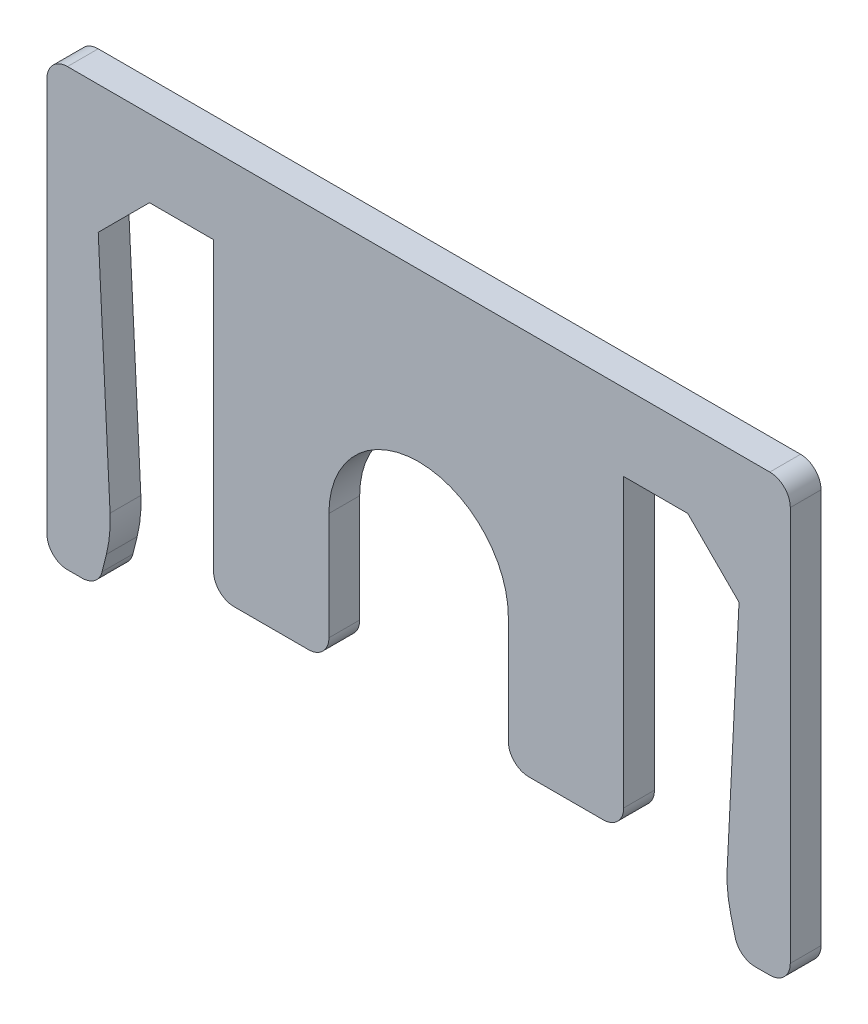
ISO-10303-21;
HEADER;
FILE_DESCRIPTION(('STEP AP214'),'2;1');
FILE_NAME('part.step','',(''),(''),'','','');
FILE_SCHEMA(('AUTOMOTIVE_DESIGN { 1 0 10303 214 1 1 1 1 }'));
ENDSEC;
DATA;
#1=APPLICATION_CONTEXT('core data for automotive mechanical design processes');
#2=APPLICATION_PROTOCOL_DEFINITION('international standard','automotive_design',2000,#1);
#3=PRODUCT_CONTEXT('',#1,'mechanical');
#4=PRODUCT('Part','Part','',(#3));
#5=PRODUCT_RELATED_PRODUCT_CATEGORY('part','',(#4));
#6=PRODUCT_DEFINITION_FORMATION('','',#4);
#7=PRODUCT_DEFINITION_CONTEXT('part definition',#1,'design');
#8=PRODUCT_DEFINITION('design','',#6,#7);
#9=PRODUCT_DEFINITION_SHAPE('','',#8);
#10=(LENGTH_UNIT() NAMED_UNIT(*) SI_UNIT(.MILLI.,.METRE.));
#11=(NAMED_UNIT(*) PLANE_ANGLE_UNIT() SI_UNIT($,.RADIAN.));
#12=(NAMED_UNIT(*) SI_UNIT($,.STERADIAN.) SOLID_ANGLE_UNIT());
#13=UNCERTAINTY_MEASURE_WITH_UNIT(LENGTH_MEASURE(1.E-05),#10,'distance_accuracy_value','');
#14=(GEOMETRIC_REPRESENTATION_CONTEXT(3) GLOBAL_UNCERTAINTY_ASSIGNED_CONTEXT((#13)) GLOBAL_UNIT_ASSIGNED_CONTEXT((#10,
#11,#12)) REPRESENTATION_CONTEXT('',''));
#15=CARTESIAN_POINT('',(0.,0.,0.));
#16=DIRECTION('',(0.,0.,1.));
#17=DIRECTION('',(1.,0.,0.));
#18=AXIS2_PLACEMENT_3D('',#15,#16,#17);
#19=CARTESIAN_POINT('',(-10.5,0.,1.2));
#20=DIRECTION('',(0.,1.,0.));
#21=DIRECTION('',(-1.,0.,0.));
#22=AXIS2_PLACEMENT_3D('',#19,#20,#21);
#23=PLANE('',#22);
#24=DIRECTION('',(1.,0.,0.));
#25=VECTOR('',#24,1.);
#26=CARTESIAN_POINT('',(-10.5,0.,0.));
#27=LINE('',#26,#25);
#28=CARTESIAN_POINT('',(-10.5,0.,0.));
#29=VERTEX_POINT('',#28);
#30=CARTESIAN_POINT('',(-8.,0.,0.));
#31=VERTEX_POINT('',#30);
#32=EDGE_CURVE('E277',#29,#31,#27,.T.);
#33=ORIENTED_EDGE('',*,*,#32,.T.);
#34=DIRECTION('',(0.,0.,-1.));
#35=VECTOR('',#34,1.);
#36=CARTESIAN_POINT('',(-8.,0.,1.2));
#37=LINE('',#36,#35);
#38=CARTESIAN_POINT('',(-8.,0.,1.2));
#39=VERTEX_POINT('',#38);
#40=EDGE_CURVE('E256',#39,#31,#37,.T.);
#41=ORIENTED_EDGE('',*,*,#40,.F.);
#42=DIRECTION('',(1.,0.,0.));
#43=VECTOR('',#42,1.);
#44=CARTESIAN_POINT('',(-10.5,0.,1.2));
#45=LINE('',#44,#43);
#46=CARTESIAN_POINT('',(-10.5,0.,1.2));
#47=VERTEX_POINT('',#46);
#48=EDGE_CURVE('E263',#47,#39,#45,.T.);
#49=ORIENTED_EDGE('',*,*,#48,.F.);
#50=DIRECTION('',(0.,0.,-1.));
#51=VECTOR('',#50,1.);
#52=CARTESIAN_POINT('',(-10.5,0.,1.2));
#53=LINE('',#52,#51);
#54=EDGE_CURVE('E518',#47,#29,#53,.T.);
#55=ORIENTED_EDGE('',*,*,#54,.T.);
#56=EDGE_LOOP('',(#33,#41,#49,#55));
#57=FACE_BOUND('',#56,.T.);
#58=ADVANCED_FACE('F39',(#57),#23,.F.);
#59=CARTESIAN_POINT('',(-8.,-12.,1.2));
#60=DIRECTION('',(1.,0.,0.));
#61=DIRECTION('',(0.,0.,-1.));
#62=AXIS2_PLACEMENT_3D('',#59,#60,#61);
#63=PLANE('',#62);
#64=DIRECTION('',(0.,-1.,0.));
#65=VECTOR('',#64,1.);
#66=CARTESIAN_POINT('',(-8.,-12.,0.));
#67=LINE('',#66,#65);
#68=CARTESIAN_POINT('',(-8.,-11.2,0.));
#69=VERTEX_POINT('',#68);
#70=EDGE_CURVE('E549',#31,#69,#67,.T.);
#71=ORIENTED_EDGE('',*,*,#70,.T.);
#72=DIRECTION('',(0.,0.,-1.));
#73=VECTOR('',#72,1.);
#74=CARTESIAN_POINT('',(-8.,-11.2,1.2));
#75=LINE('',#74,#73);
#76=CARTESIAN_POINT('',(-8.,-11.2,1.2));
#77=VERTEX_POINT('',#76);
#78=EDGE_CURVE('E259',#69,#77,#75,.F.);
#79=ORIENTED_EDGE('',*,*,#78,.T.);
#80=DIRECTION('',(0.,-1.,0.));
#81=VECTOR('',#80,1.);
#82=CARTESIAN_POINT('',(-8.,-12.,1.2));
#83=LINE('',#82,#81);
#84=EDGE_CURVE('E251',#39,#77,#83,.T.);
#85=ORIENTED_EDGE('',*,*,#84,.F.);
#86=ORIENTED_EDGE('',*,*,#40,.T.);
#87=EDGE_LOOP('',(#71,#79,#85,#86));
#88=FACE_BOUND('',#87,.T.);
#89=ADVANCED_FACE('F254',(#88),#63,.F.);
#90=CARTESIAN_POINT('',(-8.,-12.,1.2));
#91=DIRECTION('',(0.,1.,0.));
#92=DIRECTION('',(-1.,0.,0.));
#93=AXIS2_PLACEMENT_3D('',#90,#91,#92);
#94=PLANE('',#93);
#95=DIRECTION('',(1.,0.,0.));
#96=VECTOR('',#95,1.);
#97=CARTESIAN_POINT('',(-8.,-12.,1.2));
#98=LINE('',#97,#96);
#99=CARTESIAN_POINT('',(-7.2,-12.,1.2));
#100=VERTEX_POINT('',#99);
#101=CARTESIAN_POINT('',(-4.3,-12.,1.2));
#102=VERTEX_POINT('',#101);
#103=EDGE_CURVE('E262',#100,#102,#98,.T.);
#104=ORIENTED_EDGE('',*,*,#103,.F.);
#105=DIRECTION('',(0.,0.,-1.));
#106=VECTOR('',#105,1.);
#107=CARTESIAN_POINT('',(-7.2,-12.,1.2));
#108=LINE('',#107,#106);
#109=CARTESIAN_POINT('',(-7.2,-12.,0.));
#110=VERTEX_POINT('',#109);
#111=EDGE_CURVE('E418',#100,#110,#108,.T.);
#112=ORIENTED_EDGE('',*,*,#111,.T.);
#113=DIRECTION('',(1.,0.,0.));
#114=VECTOR('',#113,1.);
#115=CARTESIAN_POINT('',(-8.,-12.,0.));
#116=LINE('',#115,#114);
#117=CARTESIAN_POINT('',(-4.3,-12.,0.));
#118=VERTEX_POINT('',#117);
#119=EDGE_CURVE('E543',#110,#118,#116,.T.);
#120=ORIENTED_EDGE('',*,*,#119,.T.);
#121=DIRECTION('',(0.,0.,-1.));
#122=VECTOR('',#121,1.);
#123=CARTESIAN_POINT('',(-4.3,-12.,1.2));
#124=LINE('',#123,#122);
#125=EDGE_CURVE('E415',#118,#102,#124,.F.);
#126=ORIENTED_EDGE('',*,*,#125,.T.);
#127=EDGE_LOOP('',(#104,#112,#120,#126));
#128=FACE_BOUND('',#127,.T.);
#129=ADVANCED_FACE('F624',(#128),#94,.F.);
#130=CARTESIAN_POINT('',(-3.5,-7.,1.2));
#131=DIRECTION('',(-1.,0.,0.));
#132=DIRECTION('',(0.,-1.,0.));
#133=AXIS2_PLACEMENT_3D('',#130,#131,#132);
#134=PLANE('',#133);
#135=DIRECTION('',(0.,1.,0.));
#136=VECTOR('',#135,1.);
#137=CARTESIAN_POINT('',(-3.5,-7.,1.2));
#138=LINE('',#137,#136);
#139=CARTESIAN_POINT('',(-3.5,-11.2,1.2));
#140=VERTEX_POINT('',#139);
#141=CARTESIAN_POINT('',(-3.5,-7.,1.2));
#142=VERTEX_POINT('',#141);
#143=EDGE_CURVE('E600',#140,#142,#138,.T.);
#144=ORIENTED_EDGE('',*,*,#143,.F.);
#145=DIRECTION('',(0.,0.,-1.));
#146=VECTOR('',#145,1.);
#147=CARTESIAN_POINT('',(-3.5,-11.2,1.2));
#148=LINE('',#147,#146);
#149=CARTESIAN_POINT('',(-3.5,-11.2,0.));
#150=VERTEX_POINT('',#149);
#151=EDGE_CURVE('E11',#140,#150,#148,.T.);
#152=ORIENTED_EDGE('',*,*,#151,.T.);
#153=DIRECTION('',(0.,1.,0.));
#154=VECTOR('',#153,1.);
#155=CARTESIAN_POINT('',(-3.5,-7.,0.));
#156=LINE('',#155,#154);
#157=CARTESIAN_POINT('',(-3.5,-7.,0.));
#158=VERTEX_POINT('',#157);
#159=EDGE_CURVE('E540',#150,#158,#156,.T.);
#160=ORIENTED_EDGE('',*,*,#159,.T.);
#161=DIRECTION('',(0.,0.,-1.));
#162=VECTOR('',#161,1.);
#163=CARTESIAN_POINT('',(-3.5,-7.,1.2));
#164=LINE('',#163,#162);
#165=EDGE_CURVE('E280',#142,#158,#164,.T.);
#166=ORIENTED_EDGE('',*,*,#165,.F.);
#167=EDGE_LOOP('',(#144,#152,#160,#166));
#168=FACE_BOUND('',#167,.T.);
#169=ADVANCED_FACE('F614',(#168),#134,.F.);
#170=CARTESIAN_POINT('',(0.,-7.,1.2));
#171=DIRECTION('',(0.,0.,-1.));
#172=DIRECTION('',(-1.,0.,0.));
#173=AXIS2_PLACEMENT_3D('',#170,#171,#172);
#174=CYLINDRICAL_SURFACE('',#173,3.5);
#175=CARTESIAN_POINT('',(0.,-7.,0.));
#176=DIRECTION('',(0.,0.,-1.));
#177=DIRECTION('',(1.,0.,0.));
#178=AXIS2_PLACEMENT_3D('',#175,#176,#177);
#179=CIRCLE('',#178,3.5);
#180=CARTESIAN_POINT('',(3.5,-7.,0.));
#181=VERTEX_POINT('',#180);
#182=EDGE_CURVE('E474',#158,#181,#179,.T.);
#183=ORIENTED_EDGE('',*,*,#182,.T.);
#184=DIRECTION('',(0.,0.,-1.));
#185=VECTOR('',#184,1.);
#186=CARTESIAN_POINT('',(3.5,-7.,1.2));
#187=LINE('',#186,#185);
#188=CARTESIAN_POINT('',(3.5,-7.,1.2));
#189=VERTEX_POINT('',#188);
#190=EDGE_CURVE('E288',#189,#181,#187,.T.);
#191=ORIENTED_EDGE('',*,*,#190,.F.);
#192=CARTESIAN_POINT('',(0.,-7.,1.2));
#193=DIRECTION('',(0.,0.,-1.));
#194=DIRECTION('',(1.,0.,0.));
#195=AXIS2_PLACEMENT_3D('',#192,#193,#194);
#196=CIRCLE('',#195,3.5);
#197=EDGE_CURVE('E450',#142,#189,#196,.T.);
#198=ORIENTED_EDGE('',*,*,#197,.F.);
#199=ORIENTED_EDGE('',*,*,#165,.T.);
#200=EDGE_LOOP('',(#183,#191,#198,#199));
#201=FACE_BOUND('',#200,.T.);
#202=ADVANCED_FACE('F616',(#201),#174,.F.);
#203=CARTESIAN_POINT('',(3.5,-7.,1.2));
#204=DIRECTION('',(1.,0.,0.));
#205=DIRECTION('',(0.,1.,0.));
#206=AXIS2_PLACEMENT_3D('',#203,#204,#205);
#207=PLANE('',#206);
#208=DIRECTION('',(0.,-1.,0.));
#209=VECTOR('',#208,1.);
#210=CARTESIAN_POINT('',(3.5,-7.,0.));
#211=LINE('',#210,#209);
#212=CARTESIAN_POINT('',(3.5,-11.2,0.));
#213=VERTEX_POINT('',#212);
#214=EDGE_CURVE('E444',#181,#213,#211,.T.);
#215=ORIENTED_EDGE('',*,*,#214,.T.);
#216=DIRECTION('',(0.,0.,-1.));
#217=VECTOR('',#216,1.);
#218=CARTESIAN_POINT('',(3.5,-11.2,1.2));
#219=LINE('',#218,#217);
#220=CARTESIAN_POINT('',(3.5,-11.2,1.2));
#221=VERTEX_POINT('',#220);
#222=EDGE_CURVE('E48',#213,#221,#219,.F.);
#223=ORIENTED_EDGE('',*,*,#222,.T.);
#224=DIRECTION('',(0.,-1.,0.));
#225=VECTOR('',#224,1.);
#226=CARTESIAN_POINT('',(3.5,-7.,1.2));
#227=LINE('',#226,#225);
#228=EDGE_CURVE('E442',#189,#221,#227,.T.);
#229=ORIENTED_EDGE('',*,*,#228,.F.);
#230=ORIENTED_EDGE('',*,*,#190,.T.);
#231=EDGE_LOOP('',(#215,#223,#229,#230));
#232=FACE_BOUND('',#231,.T.);
#233=ADVANCED_FACE('F440',(#232),#207,.F.);
#234=CARTESIAN_POINT('',(3.5,-12.,1.2));
#235=DIRECTION('',(0.,1.,0.));
#236=DIRECTION('',(-1.,0.,0.));
#237=AXIS2_PLACEMENT_3D('',#234,#235,#236);
#238=PLANE('',#237);
#239=DIRECTION('',(1.,0.,0.));
#240=VECTOR('',#239,1.);
#241=CARTESIAN_POINT('',(3.5,-12.,0.));
#242=LINE('',#241,#240);
#243=CARTESIAN_POINT('',(4.3,-12.,0.));
#244=VERTEX_POINT('',#243);
#245=CARTESIAN_POINT('',(7.2,-12.,0.));
#246=VERTEX_POINT('',#245);
#247=EDGE_CURVE('E461',#244,#246,#242,.T.);
#248=ORIENTED_EDGE('',*,*,#247,.T.);
#249=DIRECTION('',(0.,0.,-1.));
#250=VECTOR('',#249,1.);
#251=CARTESIAN_POINT('',(7.2,-12.,1.2));
#252=LINE('',#251,#250);
#253=CARTESIAN_POINT('',(7.2,-12.,1.2));
#254=VERTEX_POINT('',#253);
#255=EDGE_CURVE('E432',#246,#254,#252,.F.);
#256=ORIENTED_EDGE('',*,*,#255,.T.);
#257=DIRECTION('',(1.,0.,0.));
#258=VECTOR('',#257,1.);
#259=CARTESIAN_POINT('',(3.5,-12.,1.2));
#260=LINE('',#259,#258);
#261=CARTESIAN_POINT('',(4.3,-12.,1.2));
#262=VERTEX_POINT('',#261);
#263=EDGE_CURVE('E453',#262,#254,#260,.T.);
#264=ORIENTED_EDGE('',*,*,#263,.F.);
#265=DIRECTION('',(0.,0.,-1.));
#266=VECTOR('',#265,1.);
#267=CARTESIAN_POINT('',(4.3,-12.,1.2));
#268=LINE('',#267,#266);
#269=EDGE_CURVE('E428',#262,#244,#268,.T.);
#270=ORIENTED_EDGE('',*,*,#269,.T.);
#271=EDGE_LOOP('',(#248,#256,#264,#270));
#272=FACE_BOUND('',#271,.T.);
#273=ADVANCED_FACE('F460',(#272),#238,.F.);
#274=CARTESIAN_POINT('',(8.,-12.,1.2));
#275=DIRECTION('',(-1.,0.,0.));
#276=DIRECTION('',(0.,0.,1.));
#277=AXIS2_PLACEMENT_3D('',#274,#275,#276);
#278=PLANE('',#277);
#279=DIRECTION('',(0.,1.,0.));
#280=VECTOR('',#279,1.);
#281=CARTESIAN_POINT('',(8.,-12.,1.2));
#282=LINE('',#281,#280);
#283=CARTESIAN_POINT('',(8.,-11.2,1.2));
#284=VERTEX_POINT('',#283);
#285=CARTESIAN_POINT('',(8.,0.,1.2));
#286=VERTEX_POINT('',#285);
#287=EDGE_CURVE('E593',#284,#286,#282,.T.);
#288=ORIENTED_EDGE('',*,*,#287,.F.);
#289=DIRECTION('',(0.,0.,-1.));
#290=VECTOR('',#289,1.);
#291=CARTESIAN_POINT('',(8.,-11.2,1.2));
#292=LINE('',#291,#290);
#293=CARTESIAN_POINT('',(8.,-11.2,0.));
#294=VERTEX_POINT('',#293);
#295=EDGE_CURVE('E424',#284,#294,#292,.T.);
#296=ORIENTED_EDGE('',*,*,#295,.T.);
#297=DIRECTION('',(0.,1.,0.));
#298=VECTOR('',#297,1.);
#299=CARTESIAN_POINT('',(8.,-12.,0.));
#300=LINE('',#299,#298);
#301=CARTESIAN_POINT('',(8.,0.,0.));
#302=VERTEX_POINT('',#301);
#303=EDGE_CURVE('E468',#294,#302,#300,.T.);
#304=ORIENTED_EDGE('',*,*,#303,.T.);
#305=DIRECTION('',(0.,0.,-1.));
#306=VECTOR('',#305,1.);
#307=CARTESIAN_POINT('',(8.,0.,1.2));
#308=LINE('',#307,#306);
#309=EDGE_CURVE('E533',#286,#302,#308,.T.);
#310=ORIENTED_EDGE('',*,*,#309,.F.);
#311=EDGE_LOOP('',(#288,#296,#304,#310));
#312=FACE_BOUND('',#311,.T.);
#313=ADVANCED_FACE('F834',(#312),#278,.F.);
#314=CARTESIAN_POINT('',(8.,0.,1.2));
#315=DIRECTION('',(0.,1.,0.));
#316=DIRECTION('',(-1.,0.,0.));
#317=AXIS2_PLACEMENT_3D('',#314,#315,#316);
#318=PLANE('',#317);
#319=DIRECTION('',(1.,0.,0.));
#320=VECTOR('',#319,1.);
#321=CARTESIAN_POINT('',(8.,0.,0.));
#322=LINE('',#321,#320);
#323=CARTESIAN_POINT('',(10.5,0.,0.));
#324=VERTEX_POINT('',#323);
#325=EDGE_CURVE('E472',#302,#324,#322,.T.);
#326=ORIENTED_EDGE('',*,*,#325,.T.);
#327=DIRECTION('',(0.,0.,-1.));
#328=VECTOR('',#327,1.);
#329=CARTESIAN_POINT('',(10.5,0.,1.2));
#330=LINE('',#329,#328);
#331=CARTESIAN_POINT('',(10.5,0.,1.2));
#332=VERTEX_POINT('',#331);
#333=EDGE_CURVE('E529',#332,#324,#330,.T.);
#334=ORIENTED_EDGE('',*,*,#333,.F.);
#335=DIRECTION('',(1.,0.,0.));
#336=VECTOR('',#335,1.);
#337=CARTESIAN_POINT('',(8.,0.,1.2));
#338=LINE('',#337,#336);
#339=EDGE_CURVE('E590',#286,#332,#338,.T.);
#340=ORIENTED_EDGE('',*,*,#339,.F.);
#341=ORIENTED_EDGE('',*,*,#309,.T.);
#342=EDGE_LOOP('',(#326,#334,#340,#341));
#343=FACE_BOUND('',#342,.T.);
#344=ADVANCED_FACE('F839',(#343),#318,.F.);
#345=CARTESIAN_POINT('',(12.5,-2.,1.2));
#346=DIRECTION('',(0.707106781186547,0.707106781186548,0.));
#347=DIRECTION('',(-0.707106781186548,0.707106781186547,0.));
#348=AXIS2_PLACEMENT_3D('',#345,#346,#347);
#349=PLANE('',#348);
#350=DIRECTION('',(0.707106781186548,-0.707106781186547,0.));
#351=VECTOR('',#350,1.);
#352=CARTESIAN_POINT('',(12.5,-2.,0.));
#353=LINE('',#352,#351);
#354=CARTESIAN_POINT('',(12.5,-2.,0.));
#355=VERTEX_POINT('',#354);
#356=EDGE_CURVE('E480',#324,#355,#353,.T.);
#357=ORIENTED_EDGE('',*,*,#356,.T.);
#358=DIRECTION('',(0.,0.,-1.));
#359=VECTOR('',#358,1.);
#360=CARTESIAN_POINT('',(12.5,-2.,1.2));
#361=LINE('',#360,#359);
#362=CARTESIAN_POINT('',(12.5,-2.,1.2));
#363=VERTEX_POINT('',#362);
#364=EDGE_CURVE('E525',#363,#355,#361,.T.);
#365=ORIENTED_EDGE('',*,*,#364,.F.);
#366=DIRECTION('',(0.707106781186548,-0.707106781186547,0.));
#367=VECTOR('',#366,1.);
#368=CARTESIAN_POINT('',(12.5,-2.,1.2));
#369=LINE('',#368,#367);
#370=EDGE_CURVE('E587',#332,#363,#369,.T.);
#371=ORIENTED_EDGE('',*,*,#370,.F.);
#372=ORIENTED_EDGE('',*,*,#333,.T.);
#373=EDGE_LOOP('',(#357,#365,#371,#372));
#374=FACE_BOUND('',#373,.T.);
#375=ADVANCED_FACE('F901',(#374),#349,.F.);
#376=CARTESIAN_POINT('',(12.,-12.,1.2));
#377=DIRECTION('',(0.998752338877844,-0.0499376169438947,0.));
#378=DIRECTION('',(0.0499376169438947,0.998752338877845,0.));
#379=AXIS2_PLACEMENT_3D('',#376,#377,#378);
#380=PLANE('',#379);
#381=DIRECTION('',(-0.0499376169438947,-0.998752338877845,0.));
#382=VECTOR('',#381,1.);
#383=CARTESIAN_POINT('',(12.,-12.,0.));
#384=LINE('',#383,#382);
#385=CARTESIAN_POINT('',(12.0370903931354,-11.2581921372909,0.));
#386=VERTEX_POINT('',#385);
#387=EDGE_CURVE('E483',#355,#386,#384,.T.);
#388=ORIENTED_EDGE('',*,*,#387,.T.);
#389=DIRECTION('',(0.,0.,-1.));
#390=VECTOR('',#389,1.);
#391=CARTESIAN_POINT('',(12.0370903931354,-11.2581921372909,1.2));
#392=LINE('',#391,#390);
#393=CARTESIAN_POINT('',(12.0370903931354,-11.2581921372909,1.2));
#394=VERTEX_POINT('',#393);
#395=EDGE_CURVE('E312',#386,#394,#392,.F.);
#396=ORIENTED_EDGE('',*,*,#395,.T.);
#397=DIRECTION('',(-0.0499376169438947,-0.998752338877845,0.));
#398=VECTOR('',#397,1.);
#399=CARTESIAN_POINT('',(12.,-12.,1.2));
#400=LINE('',#399,#398);
#401=EDGE_CURVE('E583',#363,#394,#400,.T.);
#402=ORIENTED_EDGE('',*,*,#401,.F.);
#403=ORIENTED_EDGE('',*,*,#364,.T.);
#404=EDGE_LOOP('',(#388,#396,#402,#403));
#405=FACE_BOUND('',#404,.T.);
#406=ADVANCED_FACE('F826',(#405),#380,.F.);
#407=CARTESIAN_POINT('',(12.5,-14.,1.2));
#408=DIRECTION('',(0.970142500145332,0.242535625036332,0.));
#409=DIRECTION('',(-0.242535625036332,0.970142500145332,0.));
#410=AXIS2_PLACEMENT_3D('',#407,#408,#409);
#411=PLANE('',#410);
#412=DIRECTION('',(0.242535625036332,-0.970142500145332,0.));
#413=VECTOR('',#412,1.);
#414=CARTESIAN_POINT('',(12.5,-14.,0.));
#415=LINE('',#414,#413);
#416=CARTESIAN_POINT('',(12.180139586798,-12.7205583471921,0.));
#417=VERTEX_POINT('',#416);
#418=CARTESIAN_POINT('',(12.3485071250072,-13.3940285000291,0.));
#419=VERTEX_POINT('',#418);
#420=EDGE_CURVE('E487',#417,#419,#415,.T.);
#421=ORIENTED_EDGE('',*,*,#420,.T.);
#422=DIRECTION('',(0.,0.,-1.));
#423=VECTOR('',#422,1.);
#424=CARTESIAN_POINT('',(12.3485071250072,-13.3940285000291,1.2));
#425=LINE('',#424,#423);
#426=CARTESIAN_POINT('',(12.3485071250072,-13.3940285000291,1.2));
#427=VERTEX_POINT('',#426);
#428=EDGE_CURVE('E408',#419,#427,#425,.F.);
#429=ORIENTED_EDGE('',*,*,#428,.T.);
#430=DIRECTION('',(0.242535625036332,-0.970142500145332,0.));
#431=VECTOR('',#430,1.);
#432=CARTESIAN_POINT('',(12.5,-14.,1.2));
#433=LINE('',#432,#431);
#434=CARTESIAN_POINT('',(12.180139586798,-12.7205583471921,1.2));
#435=VERTEX_POINT('',#434);
#436=EDGE_CURVE('E579',#435,#427,#433,.T.);
#437=ORIENTED_EDGE('',*,*,#436,.F.);
#438=DIRECTION('',(0.,0.,-1.));
#439=VECTOR('',#438,1.);
#440=CARTESIAN_POINT('',(12.180139586798,-12.7205583471921,1.2));
#441=LINE('',#440,#439);
#442=EDGE_CURVE('E308',#435,#417,#441,.T.);
#443=ORIENTED_EDGE('',*,*,#442,.T.);
#444=EDGE_LOOP('',(#421,#429,#437,#443));
#445=FACE_BOUND('',#444,.T.);
#446=ADVANCED_FACE('F816',(#445),#411,.F.);
#447=CARTESIAN_POINT('',(12.5,-14.,1.2));
#448=DIRECTION('',(0.,1.,0.));
#449=DIRECTION('',(0.,0.,1.));
#450=AXIS2_PLACEMENT_3D('',#447,#448,#449);
#451=PLANE('',#450);
#452=DIRECTION('',(1.,0.,0.));
#453=VECTOR('',#452,1.);
#454=CARTESIAN_POINT('',(12.5,-14.,0.));
#455=LINE('',#454,#453);
#456=CARTESIAN_POINT('',(13.1246211251235,-14.,0.));
#457=VERTEX_POINT('',#456);
#458=CARTESIAN_POINT('',(13.7,-14.,0.));
#459=VERTEX_POINT('',#458);
#460=EDGE_CURVE('E491',#457,#459,#455,.T.);
#461=ORIENTED_EDGE('',*,*,#460,.T.);
#462=DIRECTION('',(0.,0.,-1.));
#463=VECTOR('',#462,1.);
#464=CARTESIAN_POINT('',(13.7,-14.,1.2));
#465=LINE('',#464,#463);
#466=CARTESIAN_POINT('',(13.7,-14.,1.2));
#467=VERTEX_POINT('',#466);
#468=EDGE_CURVE('E399',#459,#467,#465,.F.);
#469=ORIENTED_EDGE('',*,*,#468,.T.);
#470=DIRECTION('',(1.,0.,0.));
#471=VECTOR('',#470,1.);
#472=CARTESIAN_POINT('',(12.5,-14.,1.2));
#473=LINE('',#472,#471);
#474=CARTESIAN_POINT('',(13.1246211251235,-14.,1.2));
#475=VERTEX_POINT('',#474);
#476=EDGE_CURVE('E575',#475,#467,#473,.T.);
#477=ORIENTED_EDGE('',*,*,#476,.F.);
#478=DIRECTION('',(0.,0.,-1.));
#479=VECTOR('',#478,1.);
#480=CARTESIAN_POINT('',(13.1246211251235,-14.,1.2));
#481=LINE('',#480,#479);
#482=EDGE_CURVE('E395',#475,#457,#481,.T.);
#483=ORIENTED_EDGE('',*,*,#482,.T.);
#484=EDGE_LOOP('',(#461,#469,#477,#483));
#485=FACE_BOUND('',#484,.T.);
#486=ADVANCED_FACE('F805',(#485),#451,.F.);
#487=CARTESIAN_POINT('',(14.5,-14.,1.2));
#488=DIRECTION('',(-1.,0.,0.));
#489=DIRECTION('',(0.,0.,1.));
#490=AXIS2_PLACEMENT_3D('',#487,#488,#489);
#491=PLANE('',#490);
#492=DIRECTION('',(0.,1.,0.));
#493=VECTOR('',#492,1.);
#494=CARTESIAN_POINT('',(14.5,-14.,0.));
#495=LINE('',#494,#493);
#496=CARTESIAN_POINT('',(14.5,-13.2,0.));
#497=VERTEX_POINT('',#496);
#498=CARTESIAN_POINT('',(14.5,2.2,0.));
#499=VERTEX_POINT('',#498);
#500=EDGE_CURVE('E495',#497,#499,#495,.T.);
#501=ORIENTED_EDGE('',*,*,#500,.T.);
#502=DIRECTION('',(0.,0.,-1.));
#503=VECTOR('',#502,1.);
#504=CARTESIAN_POINT('',(14.5,2.2,1.2));
#505=LINE('',#504,#503);
#506=CARTESIAN_POINT('',(14.5,2.2,1.2));
#507=VERTEX_POINT('',#506);
#508=EDGE_CURVE('E356',#499,#507,#505,.F.);
#509=ORIENTED_EDGE('',*,*,#508,.T.);
#510=DIRECTION('',(0.,1.,0.));
#511=VECTOR('',#510,1.);
#512=CARTESIAN_POINT('',(14.5,-14.,1.2));
#513=LINE('',#512,#511);
#514=CARTESIAN_POINT('',(14.5,-13.2,1.2));
#515=VERTEX_POINT('',#514);
#516=EDGE_CURVE('E572',#515,#507,#513,.T.);
#517=ORIENTED_EDGE('',*,*,#516,.F.);
#518=DIRECTION('',(0.,0.,-1.));
#519=VECTOR('',#518,1.);
#520=CARTESIAN_POINT('',(14.5,-13.2,1.2));
#521=LINE('',#520,#519);
#522=EDGE_CURVE('E352',#515,#497,#521,.T.);
#523=ORIENTED_EDGE('',*,*,#522,.T.);
#524=EDGE_LOOP('',(#501,#509,#517,#523));
#525=FACE_BOUND('',#524,.T.);
#526=ADVANCED_FACE('F794',(#525),#491,.F.);
#527=CARTESIAN_POINT('',(-12.5,3.,1.2));
#528=DIRECTION('',(0.,-1.,0.));
#529=DIRECTION('',(1.,0.,0.));
#530=AXIS2_PLACEMENT_3D('',#527,#528,#529);
#531=PLANE('',#530);
#532=DIRECTION('',(-1.,0.,0.));
#533=VECTOR('',#532,1.);
#534=CARTESIAN_POINT('',(12.5,3.,1.2));
#535=LINE('',#534,#533);
#536=CARTESIAN_POINT('',(13.7,3.,1.2));
#537=VERTEX_POINT('',#536);
#538=CARTESIAN_POINT('',(-13.7,3.,1.2));
#539=VERTEX_POINT('',#538);
#540=EDGE_CURVE('E568',#537,#539,#535,.T.);
#541=ORIENTED_EDGE('',*,*,#540,.F.);
#542=DIRECTION('',(0.,0.,-1.));
#543=VECTOR('',#542,1.);
#544=CARTESIAN_POINT('',(13.7,3.,1.2));
#545=LINE('',#544,#543);
#546=CARTESIAN_POINT('',(13.7,3.,0.));
#547=VERTEX_POINT('',#546);
#548=EDGE_CURVE('E318',#537,#547,#545,.T.);
#549=ORIENTED_EDGE('',*,*,#548,.T.);
#550=DIRECTION('',(-1.,0.,0.));
#551=VECTOR('',#550,1.);
#552=CARTESIAN_POINT('',(-12.5,3.,0.));
#553=LINE('',#552,#551);
#554=CARTESIAN_POINT('',(-13.7,3.,0.));
#555=VERTEX_POINT('',#554);
#556=EDGE_CURVE('E499',#547,#555,#553,.T.);
#557=ORIENTED_EDGE('',*,*,#556,.T.);
#558=DIRECTION('',(0.,0.,-1.));
#559=VECTOR('',#558,1.);
#560=CARTESIAN_POINT('',(-13.7,3.,1.2));
#561=LINE('',#560,#559);
#562=EDGE_CURVE('E315',#555,#539,#561,.F.);
#563=ORIENTED_EDGE('',*,*,#562,.T.);
#564=EDGE_LOOP('',(#541,#549,#557,#563));
#565=FACE_BOUND('',#564,.T.);
#566=ADVANCED_FACE('F784',(#565),#531,.F.);
#567=CARTESIAN_POINT('',(-14.5,-14.,1.2));
#568=DIRECTION('',(1.,0.,0.));
#569=DIRECTION('',(0.,0.,-1.));
#570=AXIS2_PLACEMENT_3D('',#567,#568,#569);
#571=PLANE('',#570);
#572=DIRECTION('',(0.,-1.,0.));
#573=VECTOR('',#572,1.);
#574=CARTESIAN_POINT('',(-14.5,-14.,1.2));
#575=LINE('',#574,#573);
#576=CARTESIAN_POINT('',(-14.5,2.2,1.2));
#577=VERTEX_POINT('',#576);
#578=CARTESIAN_POINT('',(-14.5,-13.2,1.2));
#579=VERTEX_POINT('',#578);
#580=EDGE_CURVE('E565',#577,#579,#575,.T.);
#581=ORIENTED_EDGE('',*,*,#580,.F.);
#582=DIRECTION('',(0.,0.,-1.));
#583=VECTOR('',#582,1.);
#584=CARTESIAN_POINT('',(-14.5,2.2,1.2));
#585=LINE('',#584,#583);
#586=CARTESIAN_POINT('',(-14.5,2.2,0.));
#587=VERTEX_POINT('',#586);
#588=EDGE_CURVE('E391',#577,#587,#585,.T.);
#589=ORIENTED_EDGE('',*,*,#588,.T.);
#590=DIRECTION('',(0.,-1.,0.));
#591=VECTOR('',#590,1.);
#592=CARTESIAN_POINT('',(-14.5,-14.,0.));
#593=LINE('',#592,#591);
#594=CARTESIAN_POINT('',(-14.5,-13.2,0.));
#595=VERTEX_POINT('',#594);
#596=EDGE_CURVE('E503',#587,#595,#593,.T.);
#597=ORIENTED_EDGE('',*,*,#596,.T.);
#598=DIRECTION('',(0.,0.,-1.));
#599=VECTOR('',#598,1.);
#600=CARTESIAN_POINT('',(-14.5,-13.2,1.2));
#601=LINE('',#600,#599);
#602=EDGE_CURVE('E388',#595,#579,#601,.F.);
#603=ORIENTED_EDGE('',*,*,#602,.T.);
#604=EDGE_LOOP('',(#581,#589,#597,#603));
#605=FACE_BOUND('',#604,.T.);
#606=ADVANCED_FACE('F775',(#605),#571,.F.);
#607=CARTESIAN_POINT('',(-12.5,-14.,1.2));
#608=DIRECTION('',(0.,1.,0.));
#609=DIRECTION('',(0.,0.,1.));
#610=AXIS2_PLACEMENT_3D('',#607,#608,#609);
#611=PLANE('',#610);
#612=DIRECTION('',(1.,0.,0.));
#613=VECTOR('',#612,1.);
#614=CARTESIAN_POINT('',(-12.5,-14.,1.2));
#615=LINE('',#614,#613);
#616=CARTESIAN_POINT('',(-13.7,-14.,1.2));
#617=VERTEX_POINT('',#616);
#618=CARTESIAN_POINT('',(-13.1246211251235,-14.,1.2));
#619=VERTEX_POINT('',#618);
#620=EDGE_CURVE('E562',#617,#619,#615,.T.);
#621=ORIENTED_EDGE('',*,*,#620,.F.);
#622=DIRECTION('',(0.,0.,-1.));
#623=VECTOR('',#622,1.);
#624=CARTESIAN_POINT('',(-13.7,-14.,1.2));
#625=LINE('',#624,#623);
#626=CARTESIAN_POINT('',(-13.7,-14.,0.));
#627=VERTEX_POINT('',#626);
#628=EDGE_CURVE('E404',#617,#627,#625,.T.);
#629=ORIENTED_EDGE('',*,*,#628,.T.);
#630=DIRECTION('',(1.,0.,0.));
#631=VECTOR('',#630,1.);
#632=CARTESIAN_POINT('',(-12.5,-14.,0.));
#633=LINE('',#632,#631);
#634=CARTESIAN_POINT('',(-13.1246211251235,-14.,0.));
#635=VERTEX_POINT('',#634);
#636=EDGE_CURVE('E507',#627,#635,#633,.T.);
#637=ORIENTED_EDGE('',*,*,#636,.T.);
#638=DIRECTION('',(0.,0.,-1.));
#639=VECTOR('',#638,1.);
#640=CARTESIAN_POINT('',(-13.1246211251235,-14.,1.2));
#641=LINE('',#640,#639);
#642=EDGE_CURVE('E55',#635,#619,#641,.F.);
#643=ORIENTED_EDGE('',*,*,#642,.T.);
#644=EDGE_LOOP('',(#621,#629,#637,#643));
#645=FACE_BOUND('',#644,.T.);
#646=ADVANCED_FACE('F763',(#645),#611,.F.);
#647=CARTESIAN_POINT('',(-12.,-12.,1.2));
#648=DIRECTION('',(-0.970142500145332,0.242535625036333,0.));
#649=DIRECTION('',(-0.242535625036333,-0.970142500145332,0.));
#650=AXIS2_PLACEMENT_3D('',#647,#648,#649);
#651=PLANE('',#650);
#652=DIRECTION('',(0.242535625036333,0.970142500145332,0.));
#653=VECTOR('',#652,1.);
#654=CARTESIAN_POINT('',(-12.,-12.,1.2));
#655=LINE('',#654,#653);
#656=CARTESIAN_POINT('',(-12.3485071250073,-13.3940285000291,1.2));
#657=VERTEX_POINT('',#656);
#658=CARTESIAN_POINT('',(-12.180139586798,-12.7205583471921,1.2));
#659=VERTEX_POINT('',#658);
#660=EDGE_CURVE('E559',#657,#659,#655,.T.);
#661=ORIENTED_EDGE('',*,*,#660,.F.);
#662=DIRECTION('',(0.,0.,-1.));
#663=VECTOR('',#662,1.);
#664=CARTESIAN_POINT('',(-12.3485071250073,-13.3940285000291,1.2));
#665=LINE('',#664,#663);
#666=CARTESIAN_POINT('',(-12.3485071250073,-13.3940285000291,0.));
#667=VERTEX_POINT('',#666);
#668=EDGE_CURVE('E411',#657,#667,#665,.T.);
#669=ORIENTED_EDGE('',*,*,#668,.T.);
#670=DIRECTION('',(0.242535625036333,0.970142500145332,0.));
#671=VECTOR('',#670,1.);
#672=CARTESIAN_POINT('',(-12.,-12.,0.));
#673=LINE('',#672,#671);
#674=CARTESIAN_POINT('',(-12.180139586798,-12.7205583471921,0.));
#675=VERTEX_POINT('',#674);
#676=EDGE_CURVE('E510',#667,#675,#673,.T.);
#677=ORIENTED_EDGE('',*,*,#676,.T.);
#678=DIRECTION('',(0.,0.,-1.));
#679=VECTOR('',#678,1.);
#680=CARTESIAN_POINT('',(-12.180139586798,-12.7205583471921,1.2));
#681=LINE('',#680,#679);
#682=EDGE_CURVE('E298',#675,#659,#681,.F.);
#683=ORIENTED_EDGE('',*,*,#682,.T.);
#684=EDGE_LOOP('',(#661,#669,#677,#683));
#685=FACE_BOUND('',#684,.T.);
#686=ADVANCED_FACE('F757',(#685),#651,.F.);
#687=CARTESIAN_POINT('',(-12.5,-2.,1.2));
#688=DIRECTION('',(-0.998752338877845,-0.0499376169438921,0.));
#689=DIRECTION('',(0.0499376169438921,-0.998752338877845,0.));
#690=AXIS2_PLACEMENT_3D('',#687,#688,#689);
#691=PLANE('',#690);
#692=DIRECTION('',(-0.0499376169438921,0.998752338877845,0.));
#693=VECTOR('',#692,1.);
#694=CARTESIAN_POINT('',(-12.5,-2.,1.2));
#695=LINE('',#694,#693);
#696=CARTESIAN_POINT('',(-12.0370903931355,-11.2581921372909,1.2));
#697=VERTEX_POINT('',#696);
#698=CARTESIAN_POINT('',(-12.5,-2.,1.2));
#699=VERTEX_POINT('',#698);
#700=EDGE_CURVE('E556',#697,#699,#695,.T.);
#701=ORIENTED_EDGE('',*,*,#700,.F.);
#702=DIRECTION('',(0.,0.,-1.));
#703=VECTOR('',#702,1.);
#704=CARTESIAN_POINT('',(-12.0370903931355,-11.2581921372909,1.2));
#705=LINE('',#704,#703);
#706=CARTESIAN_POINT('',(-12.0370903931355,-11.2581921372909,0.));
#707=VERTEX_POINT('',#706);
#708=EDGE_CURVE('E279',#697,#707,#705,.T.);
#709=ORIENTED_EDGE('',*,*,#708,.T.);
#710=DIRECTION('',(-0.0499376169438921,0.998752338877845,0.));
#711=VECTOR('',#710,1.);
#712=CARTESIAN_POINT('',(-12.5,-2.,0.));
#713=LINE('',#712,#711);
#714=CARTESIAN_POINT('',(-12.5,-2.,0.));
#715=VERTEX_POINT('',#714);
#716=EDGE_CURVE('E513',#707,#715,#713,.T.);
#717=ORIENTED_EDGE('',*,*,#716,.T.);
#718=DIRECTION('',(0.,0.,-1.));
#719=VECTOR('',#718,1.);
#720=CARTESIAN_POINT('',(-12.5,-2.,1.2));
#721=LINE('',#720,#719);
#722=EDGE_CURVE('E521',#699,#715,#721,.T.);
#723=ORIENTED_EDGE('',*,*,#722,.F.);
#724=EDGE_LOOP('',(#701,#709,#717,#723));
#725=FACE_BOUND('',#724,.T.);
#726=ADVANCED_FACE('F762',(#725),#691,.F.);
#727=CARTESIAN_POINT('',(-10.5,0.,1.2));
#728=DIRECTION('',(-0.707106781186547,0.707106781186548,0.));
#729=DIRECTION('',(-0.707106781186548,-0.707106781186547,0.));
#730=AXIS2_PLACEMENT_3D('',#727,#728,#729);
#731=PLANE('',#730);
#732=DIRECTION('',(0.707106781186548,0.707106781186547,0.));
#733=VECTOR('',#732,1.);
#734=CARTESIAN_POINT('',(-10.5,0.,0.));
#735=LINE('',#734,#733);
#736=EDGE_CURVE('E274',#715,#29,#735,.T.);
#737=ORIENTED_EDGE('',*,*,#736,.T.);
#738=ORIENTED_EDGE('',*,*,#54,.F.);
#739=DIRECTION('',(0.707106781186548,0.707106781186547,0.));
#740=VECTOR('',#739,1.);
#741=CARTESIAN_POINT('',(-10.5,0.,1.2));
#742=LINE('',#741,#740);
#743=EDGE_CURVE('E269',#699,#47,#742,.T.);
#744=ORIENTED_EDGE('',*,*,#743,.F.);
#745=ORIENTED_EDGE('',*,*,#722,.T.);
#746=EDGE_LOOP('',(#737,#738,#744,#745));
#747=FACE_BOUND('',#746,.T.);
#748=ADVANCED_FACE('F750',(#747),#731,.F.);
#749=CARTESIAN_POINT('',(0.,-7.,1.2));
#750=DIRECTION('',(0.,0.,1.));
#751=DIRECTION('',(1.,0.,0.));
#752=AXIS2_PLACEMENT_3D('',#749,#750,#751);
#753=PLANE('',#752);
#754=ORIENTED_EDGE('',*,*,#516,.T.);
#755=CARTESIAN_POINT('',(13.7,2.2,1.2));
#756=DIRECTION('',(0.,0.,1.));
#757=DIRECTION('',(1.,0.,0.));
#758=AXIS2_PLACEMENT_3D('',#755,#756,#757);
#759=CIRCLE('',#758,0.8);
#760=EDGE_CURVE('E385',#507,#537,#759,.T.);
#761=ORIENTED_EDGE('',*,*,#760,.T.);
#762=ORIENTED_EDGE('',*,*,#540,.T.);
#763=CARTESIAN_POINT('',(-13.7,2.2,1.2));
#764=DIRECTION('',(0.,0.,1.));
#765=DIRECTION('',(1.,0.,0.));
#766=AXIS2_PLACEMENT_3D('',#763,#764,#765);
#767=CIRCLE('',#766,0.8);
#768=EDGE_CURVE('E382',#539,#577,#767,.T.);
#769=ORIENTED_EDGE('',*,*,#768,.T.);
#770=ORIENTED_EDGE('',*,*,#580,.T.);
#771=CARTESIAN_POINT('',(-13.7,-13.2,1.2));
#772=DIRECTION('',(0.,0.,1.));
#773=DIRECTION('',(1.,0.,0.));
#774=AXIS2_PLACEMENT_3D('',#771,#772,#773);
#775=CIRCLE('',#774,0.8);
#776=EDGE_CURVE('E62',#579,#617,#775,.T.);
#777=ORIENTED_EDGE('',*,*,#776,.T.);
#778=ORIENTED_EDGE('',*,*,#620,.T.);
#779=CARTESIAN_POINT('',(-13.1246211251235,-13.2,1.2));
#780=DIRECTION('',(0.,0.,1.));
#781=DIRECTION('',(1.,0.,0.));
#782=AXIS2_PLACEMENT_3D('',#779,#780,#781);
#783=CIRCLE('',#782,0.8);
#784=EDGE_CURVE('E371',#619,#657,#783,.T.);
#785=ORIENTED_EDGE('',*,*,#784,.T.);
#786=ORIENTED_EDGE('',*,*,#660,.T.);
#787=CARTESIAN_POINT('',(-17.0308520875247,-11.5078802220104,1.2));
#788=DIRECTION('',(0.,0.,1.));
#789=DIRECTION('',(1.,0.,0.));
#790=AXIS2_PLACEMENT_3D('',#787,#788,#789);
#791=CIRCLE('',#790,5.);
#792=EDGE_CURVE('E305',#659,#697,#791,.T.);
#793=ORIENTED_EDGE('',*,*,#792,.T.);
#794=ORIENTED_EDGE('',*,*,#700,.T.);
#795=ORIENTED_EDGE('',*,*,#743,.T.);
#796=ORIENTED_EDGE('',*,*,#48,.T.);
#797=ORIENTED_EDGE('',*,*,#84,.T.);
#798=CARTESIAN_POINT('',(-7.2,-11.2,1.2));
#799=DIRECTION('',(0.,0.,1.));
#800=DIRECTION('',(1.,0.,0.));
#801=AXIS2_PLACEMENT_3D('',#798,#799,#800);
#802=CIRCLE('',#801,0.8);
#803=EDGE_CURVE('E368',#77,#100,#802,.T.);
#804=ORIENTED_EDGE('',*,*,#803,.T.);
#805=ORIENTED_EDGE('',*,*,#103,.T.);
#806=CARTESIAN_POINT('',(-4.3,-11.2,1.2));
#807=DIRECTION('',(0.,0.,1.));
#808=DIRECTION('',(1.,0.,0.));
#809=AXIS2_PLACEMENT_3D('',#806,#807,#808);
#810=CIRCLE('',#809,0.8);
#811=EDGE_CURVE('E359',#102,#140,#810,.T.);
#812=ORIENTED_EDGE('',*,*,#811,.T.);
#813=ORIENTED_EDGE('',*,*,#143,.T.);
#814=ORIENTED_EDGE('',*,*,#197,.T.);
#815=ORIENTED_EDGE('',*,*,#228,.T.);
#816=CARTESIAN_POINT('',(4.3,-11.2,1.2));
#817=DIRECTION('',(0.,0.,1.));
#818=DIRECTION('',(1.,0.,0.));
#819=AXIS2_PLACEMENT_3D('',#816,#817,#818);
#820=CIRCLE('',#819,0.8);
#821=EDGE_CURVE('E362',#221,#262,#820,.T.);
#822=ORIENTED_EDGE('',*,*,#821,.T.);
#823=ORIENTED_EDGE('',*,*,#263,.T.);
#824=CARTESIAN_POINT('',(7.2,-11.2,1.2));
#825=DIRECTION('',(0.,0.,1.));
#826=DIRECTION('',(1.,0.,0.));
#827=AXIS2_PLACEMENT_3D('',#824,#825,#826);
#828=CIRCLE('',#827,0.8);
#829=EDGE_CURVE('E365',#254,#284,#828,.T.);
#830=ORIENTED_EDGE('',*,*,#829,.T.);
#831=ORIENTED_EDGE('',*,*,#287,.T.);
#832=ORIENTED_EDGE('',*,*,#339,.T.);
#833=ORIENTED_EDGE('',*,*,#370,.T.);
#834=ORIENTED_EDGE('',*,*,#401,.T.);
#835=CARTESIAN_POINT('',(17.0308520875247,-11.5078802220104,1.2));
#836=DIRECTION('',(0.,0.,1.));
#837=DIRECTION('',(1.,0.,0.));
#838=AXIS2_PLACEMENT_3D('',#835,#836,#837);
#839=CIRCLE('',#838,5.);
#840=EDGE_CURVE('E302',#394,#435,#839,.T.);
#841=ORIENTED_EDGE('',*,*,#840,.T.);
#842=ORIENTED_EDGE('',*,*,#436,.T.);
#843=CARTESIAN_POINT('',(13.1246211251235,-13.2,1.2));
#844=DIRECTION('',(0.,0.,1.));
#845=DIRECTION('',(1.,0.,0.));
#846=AXIS2_PLACEMENT_3D('',#843,#844,#845);
#847=CIRCLE('',#846,0.8);
#848=EDGE_CURVE('E374',#427,#475,#847,.T.);
#849=ORIENTED_EDGE('',*,*,#848,.T.);
#850=ORIENTED_EDGE('',*,*,#476,.T.);
#851=CARTESIAN_POINT('',(13.7,-13.2,1.2));
#852=DIRECTION('',(0.,0.,1.));
#853=DIRECTION('',(1.,0.,0.));
#854=AXIS2_PLACEMENT_3D('',#851,#852,#853);
#855=CIRCLE('',#854,0.8);
#856=EDGE_CURVE('E379',#467,#515,#855,.T.);
#857=ORIENTED_EDGE('',*,*,#856,.T.);
#858=EDGE_LOOP('',(#754,#761,#762,#769,#770,#777,#778,#785,#786,#793,#794,#795,#796,#797,#804,
#805,#812,#813,#814,#815,#822,#823,#830,#831,#832,#833,#834,#841,#842,#849,#850,#857));
#859=FACE_BOUND('',#858,.T.);
#860=ADVANCED_FACE('F267',(#859),#753,.T.);
#861=CARTESIAN_POINT('',(0.,-7.,0.));
#862=DIRECTION('',(0.,0.,1.));
#863=DIRECTION('',(1.,0.,0.));
#864=AXIS2_PLACEMENT_3D('',#861,#862,#863);
#865=PLANE('',#864);
#866=ORIENTED_EDGE('',*,*,#556,.F.);
#867=CARTESIAN_POINT('',(13.7,2.2,0.));
#868=DIRECTION('',(0.,0.,1.));
#869=DIRECTION('',(1.,0.,0.));
#870=AXIS2_PLACEMENT_3D('',#867,#868,#869);
#871=CIRCLE('',#870,0.8);
#872=EDGE_CURVE('E349',#547,#499,#871,.F.);
#873=ORIENTED_EDGE('',*,*,#872,.T.);
#874=ORIENTED_EDGE('',*,*,#500,.F.);
#875=CARTESIAN_POINT('',(13.7,-13.2,0.));
#876=DIRECTION('',(0.,0.,1.));
#877=DIRECTION('',(1.,0.,0.));
#878=AXIS2_PLACEMENT_3D('',#875,#876,#877);
#879=CIRCLE('',#878,0.8);
#880=EDGE_CURVE('E343',#497,#459,#879,.F.);
#881=ORIENTED_EDGE('',*,*,#880,.T.);
#882=ORIENTED_EDGE('',*,*,#460,.F.);
#883=CARTESIAN_POINT('',(13.1246211251235,-13.2,0.));
#884=DIRECTION('',(0.,0.,1.));
#885=DIRECTION('',(1.,0.,0.));
#886=AXIS2_PLACEMENT_3D('',#883,#884,#885);
#887=CIRCLE('',#886,0.8);
#888=EDGE_CURVE('E337',#457,#419,#887,.F.);
#889=ORIENTED_EDGE('',*,*,#888,.T.);
#890=ORIENTED_EDGE('',*,*,#420,.F.);
#891=CARTESIAN_POINT('',(17.0308520875247,-11.5078802220104,0.));
#892=DIRECTION('',(0.,0.,1.));
#893=DIRECTION('',(1.,0.,0.));
#894=AXIS2_PLACEMENT_3D('',#891,#892,#893);
#895=CIRCLE('',#894,5.);
#896=EDGE_CURVE('E285',#417,#386,#895,.F.);
#897=ORIENTED_EDGE('',*,*,#896,.T.);
#898=ORIENTED_EDGE('',*,*,#387,.F.);
#899=ORIENTED_EDGE('',*,*,#356,.F.);
#900=ORIENTED_EDGE('',*,*,#325,.F.);
#901=ORIENTED_EDGE('',*,*,#303,.F.);
#902=CARTESIAN_POINT('',(7.2,-11.2,0.));
#903=DIRECTION('',(0.,0.,1.));
#904=DIRECTION('',(1.,0.,0.));
#905=AXIS2_PLACEMENT_3D('',#902,#903,#904);
#906=CIRCLE('',#905,0.8);
#907=EDGE_CURVE('E328',#294,#246,#906,.F.);
#908=ORIENTED_EDGE('',*,*,#907,.T.);
#909=ORIENTED_EDGE('',*,*,#247,.F.);
#910=CARTESIAN_POINT('',(4.3,-11.2,0.));
#911=DIRECTION('',(0.,0.,1.));
#912=DIRECTION('',(1.,0.,0.));
#913=AXIS2_PLACEMENT_3D('',#910,#911,#912);
#914=CIRCLE('',#913,0.8);
#915=EDGE_CURVE('E325',#244,#213,#914,.F.);
#916=ORIENTED_EDGE('',*,*,#915,.T.);
#917=ORIENTED_EDGE('',*,*,#214,.F.);
#918=ORIENTED_EDGE('',*,*,#182,.F.);
#919=ORIENTED_EDGE('',*,*,#159,.F.);
#920=CARTESIAN_POINT('',(-4.3,-11.2,0.));
#921=DIRECTION('',(0.,0.,1.));
#922=DIRECTION('',(1.,0.,0.));
#923=AXIS2_PLACEMENT_3D('',#920,#921,#922);
#924=CIRCLE('',#923,0.8);
#925=EDGE_CURVE('E322',#150,#118,#924,.F.);
#926=ORIENTED_EDGE('',*,*,#925,.T.);
#927=ORIENTED_EDGE('',*,*,#119,.F.);
#928=CARTESIAN_POINT('',(-7.2,-11.2,0.));
#929=DIRECTION('',(0.,0.,1.));
#930=DIRECTION('',(1.,0.,0.));
#931=AXIS2_PLACEMENT_3D('',#928,#929,#930);
#932=CIRCLE('',#931,0.8);
#933=EDGE_CURVE('E331',#110,#69,#932,.F.);
#934=ORIENTED_EDGE('',*,*,#933,.T.);
#935=ORIENTED_EDGE('',*,*,#70,.F.);
#936=ORIENTED_EDGE('',*,*,#32,.F.);
#937=ORIENTED_EDGE('',*,*,#736,.F.);
#938=ORIENTED_EDGE('',*,*,#716,.F.);
#939=CARTESIAN_POINT('',(-17.0308520875247,-11.5078802220104,0.));
#940=DIRECTION('',(0.,0.,1.));
#941=DIRECTION('',(1.,0.,0.));
#942=AXIS2_PLACEMENT_3D('',#939,#940,#941);
#943=CIRCLE('',#942,5.);
#944=EDGE_CURVE('E294',#707,#675,#943,.F.);
#945=ORIENTED_EDGE('',*,*,#944,.T.);
#946=ORIENTED_EDGE('',*,*,#676,.F.);
#947=CARTESIAN_POINT('',(-13.1246211251235,-13.2,0.));
#948=DIRECTION('',(0.,0.,1.));
#949=DIRECTION('',(1.,0.,0.));
#950=AXIS2_PLACEMENT_3D('',#947,#948,#949);
#951=CIRCLE('',#950,0.8);
#952=EDGE_CURVE('E334',#667,#635,#951,.F.);
#953=ORIENTED_EDGE('',*,*,#952,.T.);
#954=ORIENTED_EDGE('',*,*,#636,.F.);
#955=CARTESIAN_POINT('',(-13.7,-13.2,0.));
#956=DIRECTION('',(0.,0.,1.));
#957=DIRECTION('',(1.,0.,0.));
#958=AXIS2_PLACEMENT_3D('',#955,#956,#957);
#959=CIRCLE('',#958,0.8);
#960=EDGE_CURVE('E340',#627,#595,#959,.F.);
#961=ORIENTED_EDGE('',*,*,#960,.T.);
#962=ORIENTED_EDGE('',*,*,#596,.F.);
#963=CARTESIAN_POINT('',(-13.7,2.2,0.));
#964=DIRECTION('',(0.,0.,1.));
#965=DIRECTION('',(1.,0.,0.));
#966=AXIS2_PLACEMENT_3D('',#963,#964,#965);
#967=CIRCLE('',#966,0.8);
#968=EDGE_CURVE('E346',#587,#555,#967,.F.);
#969=ORIENTED_EDGE('',*,*,#968,.T.);
#970=EDGE_LOOP('',(#866,#873,#874,#881,#882,#889,#890,#897,#898,#899,#900,#901,#908,#909,#916,
#917,#918,#919,#926,#927,#934,#935,#936,#937,#938,#945,#946,#953,#954,#961,#962,#969));
#971=FACE_BOUND('',#970,.T.);
#972=ADVANCED_FACE('F465',(#971),#865,.F.);
#973=CARTESIAN_POINT('',(-17.0308520875247,-11.5078802220104,1.2));
#974=DIRECTION('',(0.,0.,-1.));
#975=DIRECTION('',(-1.,0.,0.));
#976=AXIS2_PLACEMENT_3D('',#973,#974,#975);
#977=CYLINDRICAL_SURFACE('',#976,5.);
#978=ORIENTED_EDGE('',*,*,#792,.F.);
#979=ORIENTED_EDGE('',*,*,#682,.F.);
#980=ORIENTED_EDGE('',*,*,#944,.F.);
#981=ORIENTED_EDGE('',*,*,#708,.F.);
#982=EDGE_LOOP('',(#978,#979,#980,#981));
#983=FACE_BOUND('',#982,.T.);
#984=ADVANCED_FACE('F634',(#983),#977,.T.);
#985=CARTESIAN_POINT('',(17.0308520875247,-11.5078802220104,1.2));
#986=DIRECTION('',(0.,0.,-1.));
#987=DIRECTION('',(-1.,0.,0.));
#988=AXIS2_PLACEMENT_3D('',#985,#986,#987);
#989=CYLINDRICAL_SURFACE('',#988,5.);
#990=ORIENTED_EDGE('',*,*,#840,.F.);
#991=ORIENTED_EDGE('',*,*,#395,.F.);
#992=ORIENTED_EDGE('',*,*,#896,.F.);
#993=ORIENTED_EDGE('',*,*,#442,.F.);
#994=EDGE_LOOP('',(#990,#991,#992,#993));
#995=FACE_BOUND('',#994,.T.);
#996=ADVANCED_FACE('F637',(#995),#989,.T.);
#997=CARTESIAN_POINT('',(13.7,2.2,1.2));
#998=DIRECTION('',(0.,0.,-1.));
#999=DIRECTION('',(-1.,0.,0.));
#1000=AXIS2_PLACEMENT_3D('',#997,#998,#999);
#1001=CYLINDRICAL_SURFACE('',#1000,0.8);
#1002=ORIENTED_EDGE('',*,*,#760,.F.);
#1003=ORIENTED_EDGE('',*,*,#508,.F.);
#1004=ORIENTED_EDGE('',*,*,#872,.F.);
#1005=ORIENTED_EDGE('',*,*,#548,.F.);
#1006=EDGE_LOOP('',(#1002,#1003,#1004,#1005));
#1007=FACE_BOUND('',#1006,.T.);
#1008=ADVANCED_FACE('F641',(#1007),#1001,.T.);
#1009=CARTESIAN_POINT('',(-13.7,2.2,1.2));
#1010=DIRECTION('',(0.,0.,-1.));
#1011=DIRECTION('',(-1.,0.,0.));
#1012=AXIS2_PLACEMENT_3D('',#1009,#1010,#1011);
#1013=CYLINDRICAL_SURFACE('',#1012,0.8);
#1014=ORIENTED_EDGE('',*,*,#768,.F.);
#1015=ORIENTED_EDGE('',*,*,#562,.F.);
#1016=ORIENTED_EDGE('',*,*,#968,.F.);
#1017=ORIENTED_EDGE('',*,*,#588,.F.);
#1018=EDGE_LOOP('',(#1014,#1015,#1016,#1017));
#1019=FACE_BOUND('',#1018,.T.);
#1020=ADVANCED_FACE('F645',(#1019),#1013,.T.);
#1021=CARTESIAN_POINT('',(13.7,-13.2,1.2));
#1022=DIRECTION('',(0.,0.,-1.));
#1023=DIRECTION('',(-1.,0.,0.));
#1024=AXIS2_PLACEMENT_3D('',#1021,#1022,#1023);
#1025=CYLINDRICAL_SURFACE('',#1024,0.8);
#1026=ORIENTED_EDGE('',*,*,#856,.F.);
#1027=ORIENTED_EDGE('',*,*,#468,.F.);
#1028=ORIENTED_EDGE('',*,*,#880,.F.);
#1029=ORIENTED_EDGE('',*,*,#522,.F.);
#1030=EDGE_LOOP('',(#1026,#1027,#1028,#1029));
#1031=FACE_BOUND('',#1030,.T.);
#1032=ADVANCED_FACE('F649',(#1031),#1025,.T.);
#1033=CARTESIAN_POINT('',(-13.7,-13.2,1.2));
#1034=DIRECTION('',(0.,0.,-1.));
#1035=DIRECTION('',(-1.,0.,0.));
#1036=AXIS2_PLACEMENT_3D('',#1033,#1034,#1035);
#1037=CYLINDRICAL_SURFACE('',#1036,0.8);
#1038=ORIENTED_EDGE('',*,*,#776,.F.);
#1039=ORIENTED_EDGE('',*,*,#602,.F.);
#1040=ORIENTED_EDGE('',*,*,#960,.F.);
#1041=ORIENTED_EDGE('',*,*,#628,.F.);
#1042=EDGE_LOOP('',(#1038,#1039,#1040,#1041));
#1043=FACE_BOUND('',#1042,.T.);
#1044=ADVANCED_FACE('F653',(#1043),#1037,.T.);
#1045=CARTESIAN_POINT('',(13.1246211251235,-13.2,1.2));
#1046=DIRECTION('',(0.,0.,-1.));
#1047=DIRECTION('',(-1.,0.,0.));
#1048=AXIS2_PLACEMENT_3D('',#1045,#1046,#1047);
#1049=CYLINDRICAL_SURFACE('',#1048,0.8);
#1050=ORIENTED_EDGE('',*,*,#848,.F.);
#1051=ORIENTED_EDGE('',*,*,#428,.F.);
#1052=ORIENTED_EDGE('',*,*,#888,.F.);
#1053=ORIENTED_EDGE('',*,*,#482,.F.);
#1054=EDGE_LOOP('',(#1050,#1051,#1052,#1053));
#1055=FACE_BOUND('',#1054,.T.);
#1056=ADVANCED_FACE('F657',(#1055),#1049,.T.);
#1057=CARTESIAN_POINT('',(-13.1246211251235,-13.2,1.2));
#1058=DIRECTION('',(0.,0.,-1.));
#1059=DIRECTION('',(-1.,0.,0.));
#1060=AXIS2_PLACEMENT_3D('',#1057,#1058,#1059);
#1061=CYLINDRICAL_SURFACE('',#1060,0.8);
#1062=ORIENTED_EDGE('',*,*,#784,.F.);
#1063=ORIENTED_EDGE('',*,*,#642,.F.);
#1064=ORIENTED_EDGE('',*,*,#952,.F.);
#1065=ORIENTED_EDGE('',*,*,#668,.F.);
#1066=EDGE_LOOP('',(#1062,#1063,#1064,#1065));
#1067=FACE_BOUND('',#1066,.T.);
#1068=ADVANCED_FACE('F661',(#1067),#1061,.T.);
#1069=CARTESIAN_POINT('',(-7.2,-11.2,1.2));
#1070=DIRECTION('',(0.,0.,-1.));
#1071=DIRECTION('',(-1.,0.,0.));
#1072=AXIS2_PLACEMENT_3D('',#1069,#1070,#1071);
#1073=CYLINDRICAL_SURFACE('',#1072,0.8);
#1074=ORIENTED_EDGE('',*,*,#803,.F.);
#1075=ORIENTED_EDGE('',*,*,#78,.F.);
#1076=ORIENTED_EDGE('',*,*,#933,.F.);
#1077=ORIENTED_EDGE('',*,*,#111,.F.);
#1078=EDGE_LOOP('',(#1074,#1075,#1076,#1077));
#1079=FACE_BOUND('',#1078,.T.);
#1080=ADVANCED_FACE('F665',(#1079),#1073,.T.);
#1081=CARTESIAN_POINT('',(7.2,-11.2,1.2));
#1082=DIRECTION('',(0.,0.,-1.));
#1083=DIRECTION('',(-1.,0.,0.));
#1084=AXIS2_PLACEMENT_3D('',#1081,#1082,#1083);
#1085=CYLINDRICAL_SURFACE('',#1084,0.8);
#1086=ORIENTED_EDGE('',*,*,#829,.F.);
#1087=ORIENTED_EDGE('',*,*,#255,.F.);
#1088=ORIENTED_EDGE('',*,*,#907,.F.);
#1089=ORIENTED_EDGE('',*,*,#295,.F.);
#1090=EDGE_LOOP('',(#1086,#1087,#1088,#1089));
#1091=FACE_BOUND('',#1090,.T.);
#1092=ADVANCED_FACE('F669',(#1091),#1085,.T.);
#1093=CARTESIAN_POINT('',(4.3,-11.2,1.2));
#1094=DIRECTION('',(0.,0.,-1.));
#1095=DIRECTION('',(-1.,0.,0.));
#1096=AXIS2_PLACEMENT_3D('',#1093,#1094,#1095);
#1097=CYLINDRICAL_SURFACE('',#1096,0.8);
#1098=ORIENTED_EDGE('',*,*,#821,.F.);
#1099=ORIENTED_EDGE('',*,*,#222,.F.);
#1100=ORIENTED_EDGE('',*,*,#915,.F.);
#1101=ORIENTED_EDGE('',*,*,#269,.F.);
#1102=EDGE_LOOP('',(#1098,#1099,#1100,#1101));
#1103=FACE_BOUND('',#1102,.T.);
#1104=ADVANCED_FACE('F456',(#1103),#1097,.T.);
#1105=CARTESIAN_POINT('',(-4.3,-11.2,1.2));
#1106=DIRECTION('',(0.,0.,-1.));
#1107=DIRECTION('',(-1.,0.,0.));
#1108=AXIS2_PLACEMENT_3D('',#1105,#1106,#1107);
#1109=CYLINDRICAL_SURFACE('',#1108,0.8);
#1110=ORIENTED_EDGE('',*,*,#811,.F.);
#1111=ORIENTED_EDGE('',*,*,#125,.F.);
#1112=ORIENTED_EDGE('',*,*,#925,.F.);
#1113=ORIENTED_EDGE('',*,*,#151,.F.);
#1114=EDGE_LOOP('',(#1110,#1111,#1112,#1113));
#1115=FACE_BOUND('',#1114,.T.);
#1116=ADVANCED_FACE('F41',(#1115),#1109,.T.);
#1117=CLOSED_SHELL('',(#58,#89,#129,#169,#202,#233,#273,#313,#344,#375,#406,#446,#486,#526,#566,
#606,#646,#686,#726,#748,#860,#972,#984,#996,#1008,#1020,#1032,#1044,#1056,#1068,#1080,#1092,
#1104,#1116));
#1118=MANIFOLD_SOLID_BREP('B2',#1117);
#1119=ADVANCED_BREP_SHAPE_REPRESENTATION('',(#18,#1118),#14);
#1120=SHAPE_DEFINITION_REPRESENTATION(#9,#1119);
ENDSEC;
END-ISO-10303-21;
